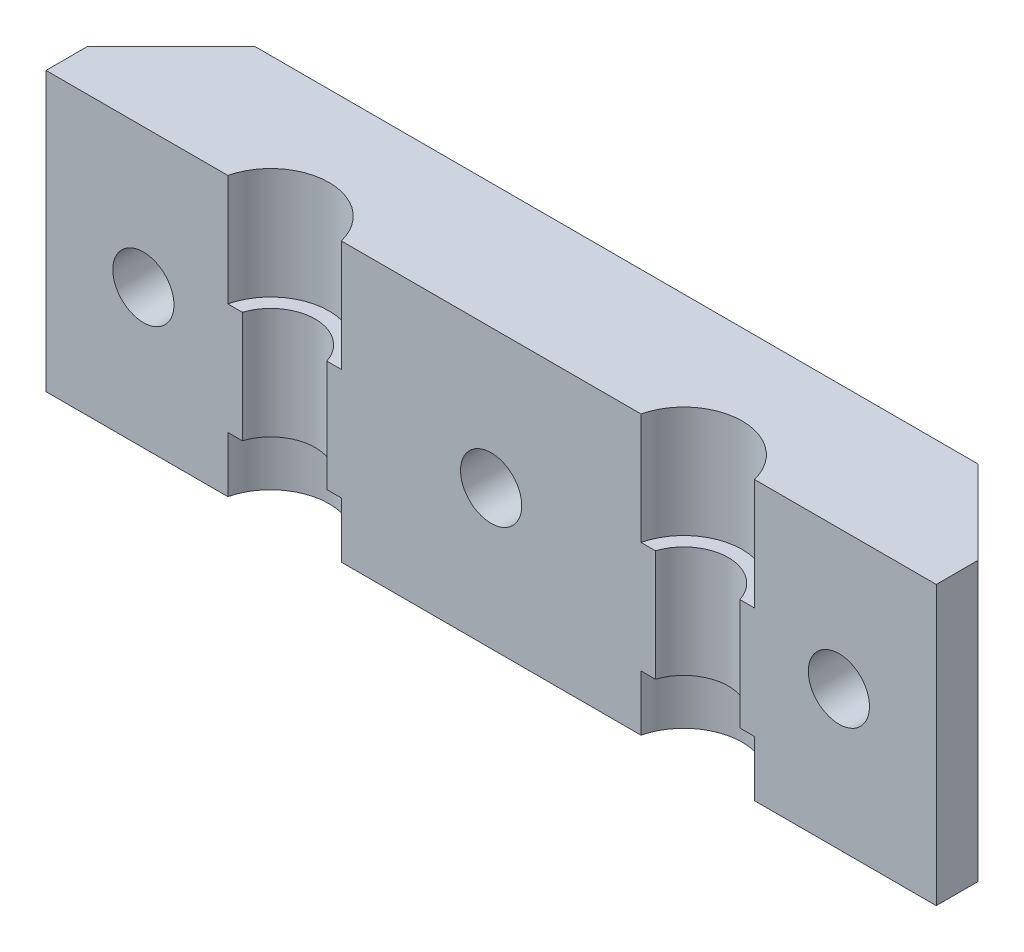
ISO-10303-21;
HEADER;
FILE_DESCRIPTION(('STEP AP214'),'2;1');
FILE_NAME('part.step','',(''),(''),'','','');
FILE_SCHEMA(('AUTOMOTIVE_DESIGN { 1 0 10303 214 1 1 1 1 }'));
ENDSEC;
DATA;
#1=APPLICATION_CONTEXT('core data for automotive mechanical design processes');
#2=APPLICATION_PROTOCOL_DEFINITION('international standard','automotive_design',2000,#1);
#3=PRODUCT_CONTEXT('',#1,'mechanical');
#4=PRODUCT('Part','Part','',(#3));
#5=PRODUCT_RELATED_PRODUCT_CATEGORY('part','',(#4));
#6=PRODUCT_DEFINITION_FORMATION('','',#4);
#7=PRODUCT_DEFINITION_CONTEXT('part definition',#1,'design');
#8=PRODUCT_DEFINITION('design','',#6,#7);
#9=PRODUCT_DEFINITION_SHAPE('','',#8);
#10=(LENGTH_UNIT() NAMED_UNIT(*) SI_UNIT(.MILLI.,.METRE.));
#11=(NAMED_UNIT(*) PLANE_ANGLE_UNIT() SI_UNIT($,.RADIAN.));
#12=(NAMED_UNIT(*) SI_UNIT($,.STERADIAN.) SOLID_ANGLE_UNIT());
#13=UNCERTAINTY_MEASURE_WITH_UNIT(LENGTH_MEASURE(1.E-05),#10,'distance_accuracy_value','');
#14=(GEOMETRIC_REPRESENTATION_CONTEXT(3) GLOBAL_UNCERTAINTY_ASSIGNED_CONTEXT((#13)) GLOBAL_UNIT_ASSIGNED_CONTEXT((#10,
#11,#12)) REPRESENTATION_CONTEXT('',''));
#15=CARTESIAN_POINT('',(0.,0.,0.));
#16=DIRECTION('',(0.,0.,1.));
#17=DIRECTION('',(1.,0.,0.));
#18=AXIS2_PLACEMENT_3D('',#15,#16,#17);
#19=CARTESIAN_POINT('',(23.425,0.,5.));
#20=DIRECTION('',(0.,1.,0.));
#21=DIRECTION('',(0.,0.,1.));
#22=AXIS2_PLACEMENT_3D('',#19,#20,#21);
#23=CYLINDRICAL_SURFACE('',#22,2.1);
#24=CARTESIAN_POINT('',(23.425,6.,5.));
#25=DIRECTION('',(0.,-1.,0.));
#26=DIRECTION('',(0.,0.,-1.));
#27=AXIS2_PLACEMENT_3D('',#24,#25,#26);
#28=CIRCLE('',#27,2.1);
#29=CARTESIAN_POINT('',(21.3853921945629,6.,4.5));
#30=VERTEX_POINT('',#29);
#31=CARTESIAN_POINT('',(25.4646078054371,6.,4.5));
#32=VERTEX_POINT('',#31);
#33=EDGE_CURVE('E210',#30,#32,#28,.T.);
#34=ORIENTED_EDGE('',*,*,#33,.T.);
#35=DIRECTION('',(0.,1.,0.));
#36=VECTOR('',#35,1.);
#37=CARTESIAN_POINT('',(25.4646078054371,0.,4.5));
#38=LINE('',#37,#36);
#39=CARTESIAN_POINT('',(25.4646078054371,10.,4.5));
#40=VERTEX_POINT('',#39);
#41=EDGE_CURVE('E252',#32,#40,#38,.T.);
#42=ORIENTED_EDGE('',*,*,#41,.T.);
#43=CARTESIAN_POINT('',(23.425,10.,5.));
#44=DIRECTION('',(0.,1.,0.));
#45=DIRECTION('',(0.,0.,1.));
#46=AXIS2_PLACEMENT_3D('',#43,#44,#45);
#47=CIRCLE('',#46,2.1);
#48=CARTESIAN_POINT('',(21.3853921945629,10.,4.5));
#49=VERTEX_POINT('',#48);
#50=EDGE_CURVE('E244',#40,#49,#47,.T.);
#51=ORIENTED_EDGE('',*,*,#50,.T.);
#52=DIRECTION('',(0.,1.,0.));
#53=VECTOR('',#52,1.);
#54=CARTESIAN_POINT('',(21.3853921945629,0.,4.5));
#55=LINE('',#54,#53);
#56=EDGE_CURVE('E250',#49,#30,#55,.F.);
#57=ORIENTED_EDGE('',*,*,#56,.T.);
#58=EDGE_LOOP('',(#34,#42,#51,#57));
#59=FACE_BOUND('',#58,.T.);
#60=ADVANCED_FACE('F36',(#59),#23,.F.);
#61=CARTESIAN_POINT('',(8.575,0.,5.));
#62=DIRECTION('',(0.,1.,0.));
#63=DIRECTION('',(0.,0.,1.));
#64=AXIS2_PLACEMENT_3D('',#61,#62,#63);
#65=CYLINDRICAL_SURFACE('',#64,2.1);
#66=CARTESIAN_POINT('',(8.575,6.,5.));
#67=DIRECTION('',(0.,-1.,0.));
#68=DIRECTION('',(0.,0.,-1.));
#69=AXIS2_PLACEMENT_3D('',#66,#67,#68);
#70=CIRCLE('',#69,2.1);
#71=CARTESIAN_POINT('',(6.53539219456288,6.,4.5));
#72=VERTEX_POINT('',#71);
#73=CARTESIAN_POINT('',(10.6146078054371,6.,4.5));
#74=VERTEX_POINT('',#73);
#75=EDGE_CURVE('E199',#72,#74,#70,.T.);
#76=ORIENTED_EDGE('',*,*,#75,.T.);
#77=DIRECTION('',(0.,1.,0.));
#78=VECTOR('',#77,1.);
#79=CARTESIAN_POINT('',(10.6146078054371,0.,4.5));
#80=LINE('',#79,#78);
#81=CARTESIAN_POINT('',(10.6146078054371,10.,4.5));
#82=VERTEX_POINT('',#81);
#83=EDGE_CURVE('E295',#74,#82,#80,.T.);
#84=ORIENTED_EDGE('',*,*,#83,.T.);
#85=CARTESIAN_POINT('',(8.575,10.,5.));
#86=DIRECTION('',(0.,1.,0.));
#87=DIRECTION('',(0.,0.,1.));
#88=AXIS2_PLACEMENT_3D('',#85,#86,#87);
#89=CIRCLE('',#88,2.1);
#90=CARTESIAN_POINT('',(6.53539219456288,10.,4.5));
#91=VERTEX_POINT('',#90);
#92=EDGE_CURVE('E255',#82,#91,#89,.T.);
#93=ORIENTED_EDGE('',*,*,#92,.T.);
#94=DIRECTION('',(0.,1.,0.));
#95=VECTOR('',#94,1.);
#96=CARTESIAN_POINT('',(6.53539219456288,0.,4.5));
#97=LINE('',#96,#95);
#98=EDGE_CURVE('E293',#91,#72,#97,.F.);
#99=ORIENTED_EDGE('',*,*,#98,.T.);
#100=EDGE_LOOP('',(#76,#84,#93,#99));
#101=FACE_BOUND('',#100,.T.);
#102=ADVANCED_FACE('F358',(#101),#65,.F.);
#103=CARTESIAN_POINT('',(0.,0.,4.5));
#104=DIRECTION('',(0.,0.,1.));
#105=DIRECTION('',(1.,0.,0.));
#106=AXIS2_PLACEMENT_3D('',#103,#104,#105);
#107=PLANE('',#106);
#108=CARTESIAN_POINT('',(28.5,5.,4.5));
#109=DIRECTION('',(0.,0.,-1.));
#110=DIRECTION('',(-1.,0.,0.));
#111=AXIS2_PLACEMENT_3D('',#108,#109,#110);
#112=CIRCLE('',#111,1.1);
#113=CARTESIAN_POINT('',(27.4,5.,4.5));
#114=VERTEX_POINT('',#113);
#115=EDGE_CURVE('E212',#114,#114,#112,.T.);
#116=ORIENTED_EDGE('',*,*,#115,.T.);
#117=EDGE_LOOP('',(#116));
#118=FACE_BOUND('',#117,.T.);
#119=CARTESIAN_POINT('',(25.4646078054371,0.,4.5));
#120=VERTEX_POINT('',#119);
#121=CARTESIAN_POINT('',(25.4646078054371,2.,4.5));
#122=VERTEX_POINT('',#121);
#123=EDGE_CURVE('E253',#120,#122,#38,.T.);
#124=ORIENTED_EDGE('',*,*,#123,.F.);
#125=DIRECTION('',(1.,0.,0.));
#126=VECTOR('',#125,1.);
#127=CARTESIAN_POINT('',(0.,0.,4.5));
#128=LINE('',#127,#126);
#129=CARTESIAN_POINT('',(32.,0.,4.5));
#130=VERTEX_POINT('',#129);
#131=EDGE_CURVE('E266',#120,#130,#128,.T.);
#132=ORIENTED_EDGE('',*,*,#131,.T.);
#133=DIRECTION('',(0.,1.,0.));
#134=VECTOR('',#133,1.);
#135=CARTESIAN_POINT('',(32.,0.,4.5));
#136=LINE('',#135,#134);
#137=CARTESIAN_POINT('',(32.,10.,4.5));
#138=VERTEX_POINT('',#137);
#139=EDGE_CURVE('E264',#130,#138,#136,.T.);
#140=ORIENTED_EDGE('',*,*,#139,.T.);
#141=DIRECTION('',(-1.,0.,0.));
#142=VECTOR('',#141,1.);
#143=CARTESIAN_POINT('',(0.,10.,4.5));
#144=LINE('',#143,#142);
#145=EDGE_CURVE('E269',#138,#40,#144,.T.);
#146=ORIENTED_EDGE('',*,*,#145,.T.);
#147=ORIENTED_EDGE('',*,*,#41,.F.);
#148=DIRECTION('',(-1.,0.,0.));
#149=VECTOR('',#148,1.);
#150=CARTESIAN_POINT('',(24.9448684153571,6.,4.5));
#151=LINE('',#150,#149);
#152=CARTESIAN_POINT('',(24.9448684153571,6.,4.5));
#153=VERTEX_POINT('',#152);
#154=EDGE_CURVE('E196',#32,#153,#151,.T.);
#155=ORIENTED_EDGE('',*,*,#154,.T.);
#156=DIRECTION('',(0.,1.,0.));
#157=VECTOR('',#156,1.);
#158=CARTESIAN_POINT('',(24.9448684153571,2.,4.5));
#159=LINE('',#158,#157);
#160=CARTESIAN_POINT('',(24.9448684153571,2.,4.5));
#161=VERTEX_POINT('',#160);
#162=EDGE_CURVE('E192',#161,#153,#159,.T.);
#163=ORIENTED_EDGE('',*,*,#162,.F.);
#164=DIRECTION('',(-1.,0.,0.));
#165=VECTOR('',#164,1.);
#166=CARTESIAN_POINT('',(24.9448684153571,2.,4.5));
#167=LINE('',#166,#165);
#168=EDGE_CURVE('E180',#122,#161,#167,.T.);
#169=ORIENTED_EDGE('',*,*,#168,.F.);
#170=EDGE_LOOP('',(#124,#132,#140,#146,#147,#155,#163,#169));
#171=FACE_BOUND('',#170,.T.);
#172=ADVANCED_FACE('F193',(#118,#171),#107,.T.);
#173=CARTESIAN_POINT('',(16.,5.,4.5));
#174=DIRECTION('',(0.,0.,-1.));
#175=DIRECTION('',(-1.,0.,0.));
#176=AXIS2_PLACEMENT_3D('',#173,#174,#175);
#177=CIRCLE('',#176,1.1);
#178=CARTESIAN_POINT('',(14.9,5.,4.5));
#179=VERTEX_POINT('',#178);
#180=EDGE_CURVE('E597',#179,#179,#177,.T.);
#181=ORIENTED_EDGE('',*,*,#180,.T.);
#182=EDGE_LOOP('',(#181));
#183=FACE_BOUND('',#182,.T.);
#184=ORIENTED_EDGE('',*,*,#56,.F.);
#185=EDGE_CURVE('E273',#49,#82,#144,.T.);
#186=ORIENTED_EDGE('',*,*,#185,.T.);
#187=ORIENTED_EDGE('',*,*,#83,.F.);
#188=DIRECTION('',(-1.,0.,0.));
#189=VECTOR('',#188,1.);
#190=CARTESIAN_POINT('',(10.0948684153571,6.,4.5));
#191=LINE('',#190,#189);
#192=CARTESIAN_POINT('',(10.0948684153571,6.,4.5));
#193=VERTEX_POINT('',#192);
#194=EDGE_CURVE('E233',#74,#193,#191,.T.);
#195=ORIENTED_EDGE('',*,*,#194,.T.);
#196=DIRECTION('',(0.,1.,0.));
#197=VECTOR('',#196,1.);
#198=CARTESIAN_POINT('',(10.0948684153571,2.,4.5));
#199=LINE('',#198,#197);
#200=CARTESIAN_POINT('',(10.0948684153571,2.,4.5));
#201=VERTEX_POINT('',#200);
#202=EDGE_CURVE('E241',#201,#193,#199,.T.);
#203=ORIENTED_EDGE('',*,*,#202,.F.);
#204=DIRECTION('',(-1.,0.,0.));
#205=VECTOR('',#204,1.);
#206=CARTESIAN_POINT('',(10.0948684153571,2.,4.5));
#207=LINE('',#206,#205);
#208=CARTESIAN_POINT('',(10.6146078054371,2.,4.5));
#209=VERTEX_POINT('',#208);
#210=EDGE_CURVE('E223',#209,#201,#207,.T.);
#211=ORIENTED_EDGE('',*,*,#210,.F.);
#212=CARTESIAN_POINT('',(10.6146078054371,0.,4.5));
#213=VERTEX_POINT('',#212);
#214=EDGE_CURVE('E296',#213,#209,#80,.T.);
#215=ORIENTED_EDGE('',*,*,#214,.F.);
#216=CARTESIAN_POINT('',(21.3853921945629,0.,4.5));
#217=VERTEX_POINT('',#216);
#218=EDGE_CURVE('E265',#213,#217,#128,.T.);
#219=ORIENTED_EDGE('',*,*,#218,.T.);
#220=CARTESIAN_POINT('',(21.3853921945629,2.,4.5));
#221=VERTEX_POINT('',#220);
#222=EDGE_CURVE('E248',#221,#217,#55,.F.);
#223=ORIENTED_EDGE('',*,*,#222,.F.);
#224=DIRECTION('',(-1.,0.,0.));
#225=VECTOR('',#224,1.);
#226=CARTESIAN_POINT('',(21.3853921945629,2.,4.5));
#227=LINE('',#226,#225);
#228=CARTESIAN_POINT('',(21.9051315846429,2.,4.5));
#229=VERTEX_POINT('',#228);
#230=EDGE_CURVE('E205',#229,#221,#227,.T.);
#231=ORIENTED_EDGE('',*,*,#230,.F.);
#232=DIRECTION('',(0.,1.,0.));
#233=VECTOR('',#232,1.);
#234=CARTESIAN_POINT('',(21.9051315846429,2.,4.5));
#235=LINE('',#234,#233);
#236=CARTESIAN_POINT('',(21.9051315846429,6.,4.5));
#237=VERTEX_POINT('',#236);
#238=EDGE_CURVE('E200',#229,#237,#235,.T.);
#239=ORIENTED_EDGE('',*,*,#238,.T.);
#240=DIRECTION('',(-1.,0.,0.));
#241=VECTOR('',#240,1.);
#242=CARTESIAN_POINT('',(21.3853921945629,6.,4.5));
#243=LINE('',#242,#241);
#244=EDGE_CURVE('E216',#237,#30,#243,.T.);
#245=ORIENTED_EDGE('',*,*,#244,.T.);
#246=EDGE_LOOP('',(#184,#186,#187,#195,#203,#211,#215,#219,#223,#231,#239,#245));
#247=FACE_BOUND('',#246,.T.);
#248=ADVANCED_FACE('F391',(#183,#247),#107,.T.);
#249=CARTESIAN_POINT('',(0.,0.,4.5));
#250=DIRECTION('',(0.,1.,0.));
#251=DIRECTION('',(-1.,0.,0.));
#252=AXIS2_PLACEMENT_3D('',#249,#250,#251);
#253=PLANE('',#252);
#254=DIRECTION('',(0.,0.,-1.));
#255=VECTOR('',#254,1.);
#256=CARTESIAN_POINT('',(0.,0.,4.5));
#257=LINE('',#256,#255);
#258=CARTESIAN_POINT('',(0.,0.,4.5));
#259=VERTEX_POINT('',#258);
#260=CARTESIAN_POINT('',(0.,0.,3.));
#261=VERTEX_POINT('',#260);
#262=EDGE_CURVE('E275',#259,#261,#257,.T.);
#263=ORIENTED_EDGE('',*,*,#262,.T.);
#264=DIRECTION('',(-0.707106781186549,0.,0.707106781186546));
#265=VECTOR('',#264,1.);
#266=CARTESIAN_POINT('',(0.,0.,3.));
#267=LINE('',#266,#265);
#268=CARTESIAN_POINT('',(3.00000000000001,0.,0.));
#269=VERTEX_POINT('',#268);
#270=EDGE_CURVE('E303',#261,#269,#267,.F.);
#271=ORIENTED_EDGE('',*,*,#270,.T.);
#272=DIRECTION('',(1.,0.,0.));
#273=VECTOR('',#272,1.);
#274=CARTESIAN_POINT('',(0.,0.,0.));
#275=LINE('',#274,#273);
#276=CARTESIAN_POINT('',(29.,0.,0.));
#277=VERTEX_POINT('',#276);
#278=EDGE_CURVE('E259',#269,#277,#275,.T.);
#279=ORIENTED_EDGE('',*,*,#278,.T.);
#280=DIRECTION('',(-0.707106781186549,0.,-0.707106781186546));
#281=VECTOR('',#280,1.);
#282=CARTESIAN_POINT('',(32.,0.,3.));
#283=LINE('',#282,#281);
#284=CARTESIAN_POINT('',(32.,0.,3.));
#285=VERTEX_POINT('',#284);
#286=EDGE_CURVE('E301',#277,#285,#283,.F.);
#287=ORIENTED_EDGE('',*,*,#286,.T.);
#288=DIRECTION('',(0.,0.,-1.));
#289=VECTOR('',#288,1.);
#290=CARTESIAN_POINT('',(32.,0.,4.5));
#291=LINE('',#290,#289);
#292=EDGE_CURVE('E289',#130,#285,#291,.T.);
#293=ORIENTED_EDGE('',*,*,#292,.F.);
#294=ORIENTED_EDGE('',*,*,#131,.F.);
#295=CARTESIAN_POINT('',(23.425,0.,5.));
#296=DIRECTION('',(0.,1.,0.));
#297=DIRECTION('',(0.,0.,1.));
#298=AXIS2_PLACEMENT_3D('',#295,#296,#297);
#299=CIRCLE('',#298,2.1);
#300=EDGE_CURVE('E245',#120,#217,#299,.T.);
#301=ORIENTED_EDGE('',*,*,#300,.T.);
#302=ORIENTED_EDGE('',*,*,#218,.F.);
#303=CARTESIAN_POINT('',(8.575,0.,5.));
#304=DIRECTION('',(0.,1.,0.));
#305=DIRECTION('',(0.,0.,1.));
#306=AXIS2_PLACEMENT_3D('',#303,#304,#305);
#307=CIRCLE('',#306,2.1);
#308=CARTESIAN_POINT('',(6.53539219456288,0.,4.5));
#309=VERTEX_POINT('',#308);
#310=EDGE_CURVE('E256',#213,#309,#307,.T.);
#311=ORIENTED_EDGE('',*,*,#310,.T.);
#312=EDGE_CURVE('E261',#259,#309,#128,.T.);
#313=ORIENTED_EDGE('',*,*,#312,.F.);
#314=EDGE_LOOP('',(#263,#271,#279,#287,#293,#294,#301,#302,#311,#313));
#315=FACE_BOUND('',#314,.T.);
#316=ADVANCED_FACE('F385',(#315),#253,.F.);
#317=CARTESIAN_POINT('',(32.,0.,4.5));
#318=DIRECTION('',(-1.,0.,0.));
#319=DIRECTION('',(0.,0.,1.));
#320=AXIS2_PLACEMENT_3D('',#317,#318,#319);
#321=PLANE('',#320);
#322=ORIENTED_EDGE('',*,*,#292,.T.);
#323=DIRECTION('',(0.,1.,0.));
#324=VECTOR('',#323,1.);
#325=CARTESIAN_POINT('',(32.,0.,3.));
#326=LINE('',#325,#324);
#327=CARTESIAN_POINT('',(32.,10.,3.));
#328=VERTEX_POINT('',#327);
#329=EDGE_CURVE('E317',#285,#328,#326,.T.);
#330=ORIENTED_EDGE('',*,*,#329,.T.);
#331=DIRECTION('',(0.,0.,-1.));
#332=VECTOR('',#331,1.);
#333=CARTESIAN_POINT('',(32.,10.,4.5));
#334=LINE('',#333,#332);
#335=EDGE_CURVE('E286',#138,#328,#334,.T.);
#336=ORIENTED_EDGE('',*,*,#335,.F.);
#337=ORIENTED_EDGE('',*,*,#139,.F.);
#338=EDGE_LOOP('',(#322,#330,#336,#337));
#339=FACE_BOUND('',#338,.T.);
#340=ADVANCED_FACE('F424',(#339),#321,.F.);
#341=CARTESIAN_POINT('',(0.,10.,4.5));
#342=DIRECTION('',(0.,-1.,0.));
#343=DIRECTION('',(0.,0.,-1.));
#344=AXIS2_PLACEMENT_3D('',#341,#342,#343);
#345=PLANE('',#344);
#346=DIRECTION('',(-1.,0.,0.));
#347=VECTOR('',#346,1.);
#348=CARTESIAN_POINT('',(0.,10.,0.));
#349=LINE('',#348,#347);
#350=CARTESIAN_POINT('',(29.,10.,0.));
#351=VERTEX_POINT('',#350);
#352=CARTESIAN_POINT('',(3.00000000000001,10.,0.));
#353=VERTEX_POINT('',#352);
#354=EDGE_CURVE('E278',#351,#353,#349,.T.);
#355=ORIENTED_EDGE('',*,*,#354,.T.);
#356=DIRECTION('',(0.707106781186549,0.,-0.707106781186546));
#357=VECTOR('',#356,1.);
#358=CARTESIAN_POINT('',(0.,10.,3.));
#359=LINE('',#358,#357);
#360=CARTESIAN_POINT('',(0.,10.,3.));
#361=VERTEX_POINT('',#360);
#362=EDGE_CURVE('E315',#353,#361,#359,.F.);
#363=ORIENTED_EDGE('',*,*,#362,.T.);
#364=DIRECTION('',(0.,0.,-1.));
#365=VECTOR('',#364,1.);
#366=CARTESIAN_POINT('',(0.,10.,4.5));
#367=LINE('',#366,#365);
#368=CARTESIAN_POINT('',(0.,10.,4.5));
#369=VERTEX_POINT('',#368);
#370=EDGE_CURVE('E283',#369,#361,#367,.T.);
#371=ORIENTED_EDGE('',*,*,#370,.F.);
#372=EDGE_CURVE('E268',#91,#369,#144,.T.);
#373=ORIENTED_EDGE('',*,*,#372,.F.);
#374=ORIENTED_EDGE('',*,*,#92,.F.);
#375=ORIENTED_EDGE('',*,*,#185,.F.);
#376=ORIENTED_EDGE('',*,*,#50,.F.);
#377=ORIENTED_EDGE('',*,*,#145,.F.);
#378=ORIENTED_EDGE('',*,*,#335,.T.);
#379=DIRECTION('',(0.707106781186549,0.,0.707106781186546));
#380=VECTOR('',#379,1.);
#381=CARTESIAN_POINT('',(32.,10.,3.));
#382=LINE('',#381,#380);
#383=EDGE_CURVE('E313',#328,#351,#382,.F.);
#384=ORIENTED_EDGE('',*,*,#383,.T.);
#385=EDGE_LOOP('',(#355,#363,#371,#373,#374,#375,#376,#377,#378,#384));
#386=FACE_BOUND('',#385,.T.);
#387=ADVANCED_FACE('F418',(#386),#345,.F.);
#388=CARTESIAN_POINT('',(0.,0.,4.5));
#389=DIRECTION('',(1.,0.,0.));
#390=DIRECTION('',(0.,0.,-1.));
#391=AXIS2_PLACEMENT_3D('',#388,#389,#390);
#392=PLANE('',#391);
#393=ORIENTED_EDGE('',*,*,#370,.T.);
#394=DIRECTION('',(0.,-1.,0.));
#395=VECTOR('',#394,1.);
#396=CARTESIAN_POINT('',(0.,0.,3.));
#397=LINE('',#396,#395);
#398=EDGE_CURVE('E298',#361,#261,#397,.T.);
#399=ORIENTED_EDGE('',*,*,#398,.T.);
#400=ORIENTED_EDGE('',*,*,#262,.F.);
#401=DIRECTION('',(0.,-1.,0.));
#402=VECTOR('',#401,1.);
#403=CARTESIAN_POINT('',(0.,0.,4.5));
#404=LINE('',#403,#402);
#405=EDGE_CURVE('E272',#369,#259,#404,.T.);
#406=ORIENTED_EDGE('',*,*,#405,.F.);
#407=EDGE_LOOP('',(#393,#399,#400,#406));
#408=FACE_BOUND('',#407,.T.);
#409=ADVANCED_FACE('F404',(#408),#392,.F.);
#410=CARTESIAN_POINT('',(3.50000000000001,5.,4.5));
#411=DIRECTION('',(0.,0.,-1.));
#412=DIRECTION('',(-1.,0.,0.));
#413=AXIS2_PLACEMENT_3D('',#410,#411,#412);
#414=CIRCLE('',#413,1.1);
#415=CARTESIAN_POINT('',(2.40000000000001,5.,4.5));
#416=VERTEX_POINT('',#415);
#417=EDGE_CURVE('E596',#416,#416,#414,.T.);
#418=ORIENTED_EDGE('',*,*,#417,.T.);
#419=EDGE_LOOP('',(#418));
#420=FACE_BOUND('',#419,.T.);
#421=ORIENTED_EDGE('',*,*,#98,.F.);
#422=ORIENTED_EDGE('',*,*,#372,.T.);
#423=ORIENTED_EDGE('',*,*,#405,.T.);
#424=ORIENTED_EDGE('',*,*,#312,.T.);
#425=CARTESIAN_POINT('',(6.53539219456288,2.,4.5));
#426=VERTEX_POINT('',#425);
#427=EDGE_CURVE('E292',#426,#309,#97,.F.);
#428=ORIENTED_EDGE('',*,*,#427,.F.);
#429=DIRECTION('',(-1.,0.,0.));
#430=VECTOR('',#429,1.);
#431=CARTESIAN_POINT('',(6.53539219456288,2.,4.5));
#432=LINE('',#431,#430);
#433=CARTESIAN_POINT('',(7.05513158464293,2.,4.5));
#434=VERTEX_POINT('',#433);
#435=EDGE_CURVE('E228',#434,#426,#432,.T.);
#436=ORIENTED_EDGE('',*,*,#435,.F.);
#437=DIRECTION('',(0.,1.,0.));
#438=VECTOR('',#437,1.);
#439=CARTESIAN_POINT('',(7.05513158464293,2.,4.5));
#440=LINE('',#439,#438);
#441=CARTESIAN_POINT('',(7.05513158464293,6.,4.5));
#442=VERTEX_POINT('',#441);
#443=EDGE_CURVE('E231',#434,#442,#440,.T.);
#444=ORIENTED_EDGE('',*,*,#443,.T.);
#445=DIRECTION('',(-1.,0.,0.));
#446=VECTOR('',#445,1.);
#447=CARTESIAN_POINT('',(6.53539219456288,6.,4.5));
#448=LINE('',#447,#446);
#449=EDGE_CURVE('E224',#442,#72,#448,.T.);
#450=ORIENTED_EDGE('',*,*,#449,.T.);
#451=EDGE_LOOP('',(#421,#422,#423,#424,#428,#436,#444,#450));
#452=FACE_BOUND('',#451,.T.);
#453=ADVANCED_FACE('F397',(#420,#452),#107,.T.);
#454=CARTESIAN_POINT('',(0.,0.,0.));
#455=DIRECTION('',(0.,0.,1.));
#456=DIRECTION('',(1.,0.,0.));
#457=AXIS2_PLACEMENT_3D('',#454,#455,#456);
#458=PLANE('',#457);
#459=CARTESIAN_POINT('',(16.,5.,0.));
#460=DIRECTION('',(0.,0.,1.));
#461=DIRECTION('',(1.,0.,0.));
#462=AXIS2_PLACEMENT_3D('',#459,#460,#461);
#463=CIRCLE('',#462,2.60000000000001);
#464=CARTESIAN_POINT('',(18.6,5.,0.));
#465=VERTEX_POINT('',#464);
#466=EDGE_CURVE('E324',#465,#465,#463,.T.);
#467=ORIENTED_EDGE('',*,*,#466,.T.);
#468=EDGE_LOOP('',(#467));
#469=FACE_BOUND('',#468,.T.);
#470=DIRECTION('',(0.,1.,0.));
#471=VECTOR('',#470,1.);
#472=CARTESIAN_POINT('',(3.00000000000001,0.,0.));
#473=LINE('',#472,#471);
#474=CARTESIAN_POINT('',(3.00000000000001,2.44852983556537,0.));
#475=VERTEX_POINT('',#474);
#476=EDGE_CURVE('E310',#269,#475,#473,.T.);
#477=ORIENTED_EDGE('',*,*,#476,.T.);
#478=CARTESIAN_POINT('',(3.50000000000001,5.,0.));
#479=DIRECTION('',(0.,0.,1.));
#480=DIRECTION('',(1.,0.,0.));
#481=AXIS2_PLACEMENT_3D('',#478,#479,#480);
#482=CIRCLE('',#481,2.60000000000001);
#483=CARTESIAN_POINT('',(3.00000000000001,7.55147016443462,0.));
#484=VERTEX_POINT('',#483);
#485=EDGE_CURVE('E327',#475,#484,#482,.T.);
#486=ORIENTED_EDGE('',*,*,#485,.T.);
#487=EDGE_CURVE('E309',#484,#353,#473,.T.);
#488=ORIENTED_EDGE('',*,*,#487,.T.);
#489=ORIENTED_EDGE('',*,*,#354,.F.);
#490=DIRECTION('',(0.,-1.,0.));
#491=VECTOR('',#490,1.);
#492=CARTESIAN_POINT('',(29.,0.,0.));
#493=LINE('',#492,#491);
#494=CARTESIAN_POINT('',(29.,7.55147016443462,0.));
#495=VERTEX_POINT('',#494);
#496=EDGE_CURVE('E306',#351,#495,#493,.T.);
#497=ORIENTED_EDGE('',*,*,#496,.T.);
#498=CARTESIAN_POINT('',(28.5,5.,0.));
#499=DIRECTION('',(0.,0.,1.));
#500=DIRECTION('',(1.,0.,0.));
#501=AXIS2_PLACEMENT_3D('',#498,#499,#500);
#502=CIRCLE('',#501,2.60000000000001);
#503=CARTESIAN_POINT('',(29.,2.44852983556537,0.));
#504=VERTEX_POINT('',#503);
#505=EDGE_CURVE('E321',#495,#504,#502,.T.);
#506=ORIENTED_EDGE('',*,*,#505,.T.);
#507=EDGE_CURVE('E305',#504,#277,#493,.T.);
#508=ORIENTED_EDGE('',*,*,#507,.T.);
#509=ORIENTED_EDGE('',*,*,#278,.F.);
#510=EDGE_LOOP('',(#477,#486,#488,#489,#497,#506,#508,#509));
#511=FACE_BOUND('',#510,.T.);
#512=ADVANCED_FACE('F378',(#469,#511),#458,.F.);
#513=ORIENTED_EDGE('',*,*,#214,.T.);
#514=CARTESIAN_POINT('',(8.575,2.,5.));
#515=DIRECTION('',(0.,-1.,0.));
#516=DIRECTION('',(0.,0.,-1.));
#517=AXIS2_PLACEMENT_3D('',#514,#515,#516);
#518=CIRCLE('',#517,2.1);
#519=EDGE_CURVE('E220',#426,#209,#518,.T.);
#520=ORIENTED_EDGE('',*,*,#519,.F.);
#521=ORIENTED_EDGE('',*,*,#427,.T.);
#522=ORIENTED_EDGE('',*,*,#310,.F.);
#523=EDGE_LOOP('',(#513,#520,#521,#522));
#524=FACE_BOUND('',#523,.T.);
#525=ADVANCED_FACE('F367',(#524),#65,.F.);
#526=ORIENTED_EDGE('',*,*,#123,.T.);
#527=CARTESIAN_POINT('',(23.425,2.,5.));
#528=DIRECTION('',(0.,-1.,0.));
#529=DIRECTION('',(0.,0.,-1.));
#530=AXIS2_PLACEMENT_3D('',#527,#528,#529);
#531=CIRCLE('',#530,2.1);
#532=EDGE_CURVE('E187',#221,#122,#531,.T.);
#533=ORIENTED_EDGE('',*,*,#532,.F.);
#534=ORIENTED_EDGE('',*,*,#222,.T.);
#535=ORIENTED_EDGE('',*,*,#300,.F.);
#536=EDGE_LOOP('',(#526,#533,#534,#535));
#537=FACE_BOUND('',#536,.T.);
#538=ADVANCED_FACE('F361',(#537),#23,.F.);
#539=CARTESIAN_POINT('',(8.575,2.,5.));
#540=DIRECTION('',(0.,1.,0.));
#541=DIRECTION('',(0.,0.,1.));
#542=AXIS2_PLACEMENT_3D('',#539,#540,#541);
#543=CYLINDRICAL_SURFACE('',#542,1.6);
#544=CARTESIAN_POINT('',(8.575,6.,5.));
#545=DIRECTION('',(0.,1.,0.));
#546=DIRECTION('',(0.,0.,-1.));
#547=AXIS2_PLACEMENT_3D('',#544,#545,#546);
#548=CIRCLE('',#547,1.6);
#549=EDGE_CURVE('E235',#193,#442,#548,.T.);
#550=ORIENTED_EDGE('',*,*,#549,.T.);
#551=ORIENTED_EDGE('',*,*,#443,.F.);
#552=CARTESIAN_POINT('',(8.575,2.,5.));
#553=DIRECTION('',(0.,1.,0.));
#554=DIRECTION('',(0.,0.,-1.));
#555=AXIS2_PLACEMENT_3D('',#552,#553,#554);
#556=CIRCLE('',#555,1.6);
#557=EDGE_CURVE('E226',#201,#434,#556,.T.);
#558=ORIENTED_EDGE('',*,*,#557,.F.);
#559=ORIENTED_EDGE('',*,*,#202,.T.);
#560=EDGE_LOOP('',(#550,#551,#558,#559));
#561=FACE_BOUND('',#560,.T.);
#562=ADVANCED_FACE('F370',(#561),#543,.F.);
#563=CARTESIAN_POINT('',(8.575,2.,5.));
#564=DIRECTION('',(0.,-1.,0.));
#565=DIRECTION('',(0.,0.,-1.));
#566=AXIS2_PLACEMENT_3D('',#563,#564,#565);
#567=PLANE('',#566);
#568=ORIENTED_EDGE('',*,*,#519,.T.);
#569=ORIENTED_EDGE('',*,*,#210,.T.);
#570=ORIENTED_EDGE('',*,*,#557,.T.);
#571=ORIENTED_EDGE('',*,*,#435,.T.);
#572=EDGE_LOOP('',(#568,#569,#570,#571));
#573=FACE_BOUND('',#572,.T.);
#574=ADVANCED_FACE('F376',(#573),#567,.T.);
#575=CARTESIAN_POINT('',(8.575,6.,5.));
#576=DIRECTION('',(0.,-1.,0.));
#577=DIRECTION('',(0.,0.,-1.));
#578=AXIS2_PLACEMENT_3D('',#575,#576,#577);
#579=PLANE('',#578);
#580=ORIENTED_EDGE('',*,*,#75,.F.);
#581=ORIENTED_EDGE('',*,*,#449,.F.);
#582=ORIENTED_EDGE('',*,*,#549,.F.);
#583=ORIENTED_EDGE('',*,*,#194,.F.);
#584=EDGE_LOOP('',(#580,#581,#582,#583));
#585=FACE_BOUND('',#584,.T.);
#586=ADVANCED_FACE('F446',(#585),#579,.F.);
#587=CARTESIAN_POINT('',(23.425,2.,5.));
#588=DIRECTION('',(0.,1.,0.));
#589=DIRECTION('',(0.,0.,1.));
#590=AXIS2_PLACEMENT_3D('',#587,#588,#589);
#591=CYLINDRICAL_SURFACE('',#590,1.6);
#592=CARTESIAN_POINT('',(23.425,6.,5.));
#593=DIRECTION('',(0.,1.,0.));
#594=DIRECTION('',(0.,0.,-1.));
#595=AXIS2_PLACEMENT_3D('',#592,#593,#594);
#596=CIRCLE('',#595,1.6);
#597=EDGE_CURVE('E214',#153,#237,#596,.T.);
#598=ORIENTED_EDGE('',*,*,#597,.T.);
#599=ORIENTED_EDGE('',*,*,#238,.F.);
#600=CARTESIAN_POINT('',(23.425,2.,5.));
#601=DIRECTION('',(0.,1.,0.));
#602=DIRECTION('',(0.,0.,-1.));
#603=AXIS2_PLACEMENT_3D('',#600,#601,#602);
#604=CIRCLE('',#603,1.6);
#605=EDGE_CURVE('E185',#161,#229,#604,.T.);
#606=ORIENTED_EDGE('',*,*,#605,.F.);
#607=ORIENTED_EDGE('',*,*,#162,.T.);
#608=EDGE_LOOP('',(#598,#599,#606,#607));
#609=FACE_BOUND('',#608,.T.);
#610=ADVANCED_FACE('F202',(#609),#591,.F.);
#611=CARTESIAN_POINT('',(23.425,2.,5.));
#612=DIRECTION('',(0.,-1.,0.));
#613=DIRECTION('',(0.,0.,-1.));
#614=AXIS2_PLACEMENT_3D('',#611,#612,#613);
#615=PLANE('',#614);
#616=ORIENTED_EDGE('',*,*,#532,.T.);
#617=ORIENTED_EDGE('',*,*,#168,.T.);
#618=ORIENTED_EDGE('',*,*,#605,.T.);
#619=ORIENTED_EDGE('',*,*,#230,.T.);
#620=EDGE_LOOP('',(#616,#617,#618,#619));
#621=FACE_BOUND('',#620,.T.);
#622=ADVANCED_FACE('F182',(#621),#615,.T.);
#623=CARTESIAN_POINT('',(23.425,6.,5.));
#624=DIRECTION('',(0.,-1.,0.));
#625=DIRECTION('',(0.,0.,-1.));
#626=AXIS2_PLACEMENT_3D('',#623,#624,#625);
#627=PLANE('',#626);
#628=ORIENTED_EDGE('',*,*,#33,.F.);
#629=ORIENTED_EDGE('',*,*,#244,.F.);
#630=ORIENTED_EDGE('',*,*,#597,.F.);
#631=ORIENTED_EDGE('',*,*,#154,.F.);
#632=EDGE_LOOP('',(#628,#629,#630,#631));
#633=FACE_BOUND('',#632,.T.);
#634=ADVANCED_FACE('F433',(#633),#627,.F.);
#635=CARTESIAN_POINT('',(0.,0.,3.));
#636=DIRECTION('',(0.707106781186546,0.,0.707106781186549));
#637=DIRECTION('',(0.,-1.,0.));
#638=AXIS2_PLACEMENT_3D('',#635,#636,#637);
#639=PLANE('',#638);
#640=ORIENTED_EDGE('',*,*,#487,.F.);
#641=CARTESIAN_POINT('',(3.00000000000001,7.55147016443462,0.));
#642=CARTESIAN_POINT('',(2.96599928201031,7.51015683863965,0.0340007179897028));
#643=CARTESIAN_POINT('',(2.9323477738445,7.46827060099669,0.0676522261555075));
#644=CARTESIAN_POINT('',(2.8658243429117,7.38325846201475,0.134175657088306));
#645=CARTESIAN_POINT('',(2.83295259108518,7.34013229335533,0.167047408914832));
#646=CARTESIAN_POINT('',(2.73541953272301,7.20846823427555,0.264580467277001));
#647=CARTESIAN_POINT('',(2.67208413208845,7.11793811174638,0.327915867911562));
#648=CARTESIAN_POINT('',(2.54875148774287,6.92908118806831,0.45124851225714));
#649=CARTESIAN_POINT('',(2.48884418087423,6.83063622027127,0.511155819125775));
#650=CARTESIAN_POINT('',(2.37525471887614,6.62693899999607,0.624745281123867));
#651=CARTESIAN_POINT('',(2.3215628906888,6.52169773330255,0.678437109311205));
#652=CARTESIAN_POINT('',(2.24450551474905,6.35260813621776,0.755494485250954));
#653=CARTESIAN_POINT('',(2.21832301546294,6.29131744987449,0.781676984537062));
#654=CARTESIAN_POINT('',(2.1688216134421,6.16644441785138,0.831178386557907));
#655=CARTESIAN_POINT('',(2.14550283266125,6.10286197472416,0.854497167338752));
#656=CARTESIAN_POINT('',(2.10226973882567,5.97376509600889,0.897730261174339));
#657=CARTESIAN_POINT('',(2.08234039558948,5.90826078508834,0.917659604410522));
#658=CARTESIAN_POINT('',(2.04621842841897,5.77522649396514,0.953781571581041));
#659=CARTESIAN_POINT('',(2.0300249062484,5.70769700511551,0.969975093751611));
#660=CARTESIAN_POINT('',(2.00161868447319,5.56994980231929,0.998381315526815));
#661=CARTESIAN_POINT('',(1.98946441772956,5.49970777478582,1.01053558227045));
#662=CARTESIAN_POINT('',(1.96985150609939,5.35791536834109,1.03014849390062));
#663=CARTESIAN_POINT('',(1.96239269660699,5.28636503538482,1.03760730339301));
#664=CARTESIAN_POINT('',(1.95244542262421,5.14257864245395,1.0475545773758));
#665=CARTESIAN_POINT('',(1.9499564010801,5.0703426602445,1.0500435989199));
#666=CARTESIAN_POINT('',(1.95004474950104,4.92588012718903,1.04995525049897));
#667=CARTESIAN_POINT('',(1.95262173575959,4.85365357604307,1.04737826424041));
#668=CARTESIAN_POINT('',(1.96213103054293,4.71855178634058,1.03786896945708));
#669=CARTESIAN_POINT('',(1.96850271546571,4.65559586124925,1.03149728453429));
#670=CARTESIAN_POINT('',(1.98490218464306,4.53063465970789,1.01509781535694));
#671=CARTESIAN_POINT('',(1.99493111865844,4.46862968861238,1.00506888134156));
#672=CARTESIAN_POINT('',(2.03011661133924,4.28464988275926,0.969883388660765));
#673=CARTESIAN_POINT('',(2.06038029793184,4.16460036015507,0.939619702068162));
#674=CARTESIAN_POINT('',(2.15066838967068,3.87051430945635,0.849331610329323));
#675=CARTESIAN_POINT('',(2.21798154574358,3.70100711875884,0.782018454256429));
#676=CARTESIAN_POINT('',(2.33204855337678,3.45879646008093,0.667951446623229));
#677=CARTESIAN_POINT('',(2.37246801780861,3.37973614433106,0.627531982191394));
#678=CARTESIAN_POINT('',(2.45689871188768,3.22554038351865,0.543101288112324));
#679=CARTESIAN_POINT('',(2.50090909931457,3.15040402486709,0.499090900685441));
#680=CARTESIAN_POINT('',(2.59195166900231,3.00362749162052,0.408048330997696));
#681=CARTESIAN_POINT('',(2.63899038637262,2.93199550800161,0.36100961362739));
#682=CARTESIAN_POINT('',(2.73549583790362,2.79206843331074,0.264504162096389));
#683=CARTESIAN_POINT('',(2.78496306012306,2.72377401854152,0.215036939876946));
#684=CARTESIAN_POINT('',(2.9365328464512,2.52321750431938,0.0634671535488053));
#685=CARTESIAN_POINT('',(3.04165570472524,2.39551390833235,-0.0416557047252265));
#686=CARTESIAN_POINT('',(3.2538669082044,2.15430262864424,-0.253866908204394));
#687=CARTESIAN_POINT('',(3.36076846487712,2.04046085842877,-0.360768464877107));
#688=CARTESIAN_POINT('',(3.52380871520025,1.87580448121339,-0.52380871520024));
#689=CARTESIAN_POINT('',(3.57847833224351,1.82205007218907,-0.578478332243496));
#690=CARTESIAN_POINT('',(3.6886602465896,1.71633106086898,-0.68866024658959));
#691=CARTESIAN_POINT('',(3.74417236670109,1.66436608954093,-0.744172366701081));
#692=CARTESIAN_POINT('',(3.80005453085368,1.61321124200324,-0.800054530853664));
#693=B_SPLINE_CURVE_WITH_KNOTS('',3,(#641,#642,#643,#644,#645,#646,#647,#648,#649,#650,#651,
#652,#653,#654,#655,#656,#657,#658,#659,#660,#661,#662,#663,#664,#665,#666,#667,#668,#669,#670,
#671,#672,#673,#674,#675,#676,#677,#678,#679,#680,#681,#682,#683,#684,#685,#686,#687,#688,#689,
#690,#691,#692),.UNSPECIFIED.,.F.,.F.,(4,2,2,2,2,2,2,2,2,2,2,2,2,2,2,2,2,2,2,2,2,2,2,2,2,4),(0.,
0.190175010584689,0.380391333642397,0.76217992390665,1.15146324410682,1.54013234341812,
1.75482961613688,1.96953602875364,2.183264006381,2.3969405418326,2.6135857670438,
2.83022339702916,3.046836743167,3.26343368334021,3.45400083220946,3.64462794303119,
4.02555479442605,4.60532001686543,4.89787716705318,5.19036589661897,5.48350846685455,
5.77671019332518,6.36404661981103,6.9315143434676,7.21398878582769,7.49640462083642),.UNSPECIFIED.);
#694=EDGE_CURVE('E330',#484,#475,#693,.T.);
#695=ORIENTED_EDGE('',*,*,#694,.T.);
#696=ORIENTED_EDGE('',*,*,#476,.F.);
#697=ORIENTED_EDGE('',*,*,#270,.F.);
#698=ORIENTED_EDGE('',*,*,#398,.F.);
#699=ORIENTED_EDGE('',*,*,#362,.F.);
#700=EDGE_LOOP('',(#640,#695,#696,#697,#698,#699));
#701=FACE_BOUND('',#700,.T.);
#702=ADVANCED_FACE('F338',(#701),#639,.F.);
#703=CARTESIAN_POINT('',(32.,0.,3.));
#704=DIRECTION('',(-0.707106781186546,0.,0.707106781186549));
#705=DIRECTION('',(0.,1.,0.));
#706=AXIS2_PLACEMENT_3D('',#703,#704,#705);
#707=PLANE('',#706);
#708=ORIENTED_EDGE('',*,*,#507,.F.);
#709=CARTESIAN_POINT('',(29.,2.44852983556537,0.));
#710=CARTESIAN_POINT('',(29.0340007179897,2.48984316136034,0.0340007179897029));
#711=CARTESIAN_POINT('',(29.0676522261555,2.5317293990033,0.067652226155508));
#712=CARTESIAN_POINT('',(29.1341756570883,2.61674153798525,0.134175657088307));
#713=CARTESIAN_POINT('',(29.1670474089148,2.65986770664466,0.167047408914834));
#714=CARTESIAN_POINT('',(29.264580467277,2.79153176572445,0.264580467277004));
#715=CARTESIAN_POINT('',(29.3279158679116,2.88206188825361,0.327915867911564));
#716=CARTESIAN_POINT('',(29.4512485122571,3.07091881193168,0.451248512257142));
#717=CARTESIAN_POINT('',(29.5111558191258,3.16936377972873,0.511155819125777));
#718=CARTESIAN_POINT('',(29.6247452811239,3.37306100000392,0.62474528112387));
#719=CARTESIAN_POINT('',(29.6784371093112,3.47830226669744,0.678437109311208));
#720=CARTESIAN_POINT('',(29.7554944852509,3.64739186378223,0.755494485250957));
#721=CARTESIAN_POINT('',(29.7816769845371,3.7086825501255,0.781676984537065));
#722=CARTESIAN_POINT('',(29.8311783865579,3.83355558214861,0.831178386557909));
#723=CARTESIAN_POINT('',(29.8544971673387,3.89713802527583,0.854497167338755));
#724=CARTESIAN_POINT('',(29.8977302611743,4.02623490399109,0.897730261174342));
#725=CARTESIAN_POINT('',(29.9176596044105,4.09173921491165,0.917659604410525));
#726=CARTESIAN_POINT('',(29.953781571581,4.22477350603484,0.953781571581045));
#727=CARTESIAN_POINT('',(29.9699750937516,4.29230299488447,0.969975093751615));
#728=CARTESIAN_POINT('',(29.9983813155268,4.43005019768069,0.998381315526819));
#729=CARTESIAN_POINT('',(30.0105355822704,4.50029222521416,1.01053558227045));
#730=CARTESIAN_POINT('',(30.0301484939006,4.64208463165889,1.03014849390062));
#731=CARTESIAN_POINT('',(30.037607303393,4.71363496461516,1.03760730339302));
#732=CARTESIAN_POINT('',(30.0475545773758,4.85742135754603,1.0475545773758));
#733=CARTESIAN_POINT('',(30.0500435989199,4.92965733975549,1.05004359891991));
#734=CARTESIAN_POINT('',(30.049955250499,5.07411987281095,1.04995525049897));
#735=CARTESIAN_POINT('',(30.0473782642404,5.14634642395691,1.04737826424042));
#736=CARTESIAN_POINT('',(30.0378689694571,5.2814482136594,1.03786896945709));
#737=CARTESIAN_POINT('',(30.0314972845343,5.34440413875074,1.0314972845343));
#738=CARTESIAN_POINT('',(30.0150978153569,5.46936534029209,1.01509781535695));
#739=CARTESIAN_POINT('',(30.0050688813416,5.5313703113876,1.00506888134157));
#740=CARTESIAN_POINT('',(29.9698833886608,5.71535011724073,0.969883388660774));
#741=CARTESIAN_POINT('',(29.9396197020682,5.83539963984492,0.939619702068172));
#742=CARTESIAN_POINT('',(29.8493316103293,6.12948569054363,0.849331610329335));
#743=CARTESIAN_POINT('',(29.7820184542564,6.29899288124113,0.78201845425644));
#744=CARTESIAN_POINT('',(29.6679514466232,6.54120353991904,0.667951446623242));
#745=CARTESIAN_POINT('',(29.6275319821914,6.62026385566892,0.627531982191408));
#746=CARTESIAN_POINT('',(29.5431012881123,6.77445961648132,0.543101288112339));
#747=CARTESIAN_POINT('',(29.4990909006854,6.84959597513289,0.499090900685456));
#748=CARTESIAN_POINT('',(29.4080483309977,6.99637250837946,0.408048330997712));
#749=CARTESIAN_POINT('',(29.3610096136274,7.06800449199836,0.361009613627406));
#750=CARTESIAN_POINT('',(29.2645041620964,7.20793156668923,0.264504162096407));
#751=CARTESIAN_POINT('',(29.215036939877,7.27622598145845,0.215036939876965));
#752=CARTESIAN_POINT('',(29.0634671535488,7.4767824956806,0.063467153548827));
#753=CARTESIAN_POINT('',(28.9583442952748,7.60448609166762,-0.0416557047252032));
#754=CARTESIAN_POINT('',(28.7461330917956,7.84569737135572,-0.253866908204368));
#755=CARTESIAN_POINT('',(28.6392315351229,7.9595391415712,-0.36076846487708));
#756=CARTESIAN_POINT('',(28.4761912847998,8.12419551878657,-0.523808715200211));
#757=CARTESIAN_POINT('',(28.4215216677565,8.1779499278109,-0.578478332243465));
#758=CARTESIAN_POINT('',(28.3113397534104,8.28366893913098,-0.688660246589558));
#759=CARTESIAN_POINT('',(28.2558276332989,8.33563391045904,-0.744172366701048));
#760=CARTESIAN_POINT('',(28.1999454691464,8.38678875799673,-0.800054530853632));
#761=B_SPLINE_CURVE_WITH_KNOTS('',3,(#709,#710,#711,#712,#713,#714,#715,#716,#717,#718,#719,
#720,#721,#722,#723,#724,#725,#726,#727,#728,#729,#730,#731,#732,#733,#734,#735,#736,#737,#738,
#739,#740,#741,#742,#743,#744,#745,#746,#747,#748,#749,#750,#751,#752,#753,#754,#755,#756,#757,
#758,#759,#760),.UNSPECIFIED.,.F.,.F.,(4,2,2,2,2,2,2,2,2,2,2,2,2,2,2,2,2,2,2,2,2,2,2,2,2,4),(0.,
0.190175010584691,0.380391333642398,0.762179923906651,1.15146324410682,1.54013234341812,
1.75482961613688,1.96953602875364,2.18326400638099,2.39694054183259,2.61358576704379,
2.83022339702916,3.04683674316699,3.2634336833402,3.45400083220945,3.64462794303118,
4.02555479442604,4.60532001686542,4.89787716705316,5.19036589661896,5.48350846685453,
5.77671019332515,6.364046619811,6.93151434346756,7.21398878582766,7.49640462083638),.UNSPECIFIED.);
#762=EDGE_CURVE('E11',#504,#495,#761,.T.);
#763=ORIENTED_EDGE('',*,*,#762,.T.);
#764=ORIENTED_EDGE('',*,*,#496,.F.);
#765=ORIENTED_EDGE('',*,*,#383,.F.);
#766=ORIENTED_EDGE('',*,*,#329,.F.);
#767=ORIENTED_EDGE('',*,*,#286,.F.);
#768=EDGE_LOOP('',(#708,#763,#764,#765,#766,#767));
#769=FACE_BOUND('',#768,.T.);
#770=ADVANCED_FACE('F347',(#769),#707,.F.);
#771=CARTESIAN_POINT('',(28.5,5.,4.5));
#772=DIRECTION('',(0.,0.,-1.));
#773=DIRECTION('',(-1.,0.,0.));
#774=AXIS2_PLACEMENT_3D('',#771,#772,#773);
#775=CYLINDRICAL_SURFACE('',#774,1.1);
#776=CARTESIAN_POINT('',(28.5,5.,1.50000000000001));
#777=DIRECTION('',(0.,0.,1.));
#778=DIRECTION('',(1.,0.,0.));
#779=AXIS2_PLACEMENT_3D('',#776,#777,#778);
#780=CIRCLE('',#779,1.1);
#781=CARTESIAN_POINT('',(28.7115384615385,3.92053185350843,1.50000000000001));
#782=VERTEX_POINT('',#781);
#783=EDGE_CURVE('E49',#782,#782,#780,.F.);
#784=ORIENTED_EDGE('',*,*,#783,.T.);
#785=EDGE_LOOP('',(#784));
#786=FACE_BOUND('',#785,.T.);
#787=ORIENTED_EDGE('',*,*,#115,.F.);
#788=EDGE_LOOP('',(#787));
#789=FACE_BOUND('',#788,.T.);
#790=ADVANCED_FACE('F544',(#786,#789),#775,.F.);
#791=CARTESIAN_POINT('',(16.,5.,4.5));
#792=DIRECTION('',(0.,0.,-1.));
#793=DIRECTION('',(-1.,0.,0.));
#794=AXIS2_PLACEMENT_3D('',#791,#792,#793);
#795=CYLINDRICAL_SURFACE('',#794,1.1);
#796=CARTESIAN_POINT('',(16.,5.,1.50000000000001));
#797=DIRECTION('',(0.,0.,1.));
#798=DIRECTION('',(1.,0.,0.));
#799=AXIS2_PLACEMENT_3D('',#796,#797,#798);
#800=CIRCLE('',#799,1.1);
#801=CARTESIAN_POINT('',(17.1,5.,1.50000000000001));
#802=VERTEX_POINT('',#801);
#803=EDGE_CURVE('E337',#802,#802,#800,.F.);
#804=ORIENTED_EDGE('',*,*,#803,.T.);
#805=EDGE_LOOP('',(#804));
#806=FACE_BOUND('',#805,.T.);
#807=ORIENTED_EDGE('',*,*,#180,.F.);
#808=EDGE_LOOP('',(#807));
#809=FACE_BOUND('',#808,.T.);
#810=ADVANCED_FACE('F550',(#806,#809),#795,.F.);
#811=CARTESIAN_POINT('',(3.50000000000001,5.,4.5));
#812=DIRECTION('',(0.,0.,-1.));
#813=DIRECTION('',(-1.,0.,0.));
#814=AXIS2_PLACEMENT_3D('',#811,#812,#813);
#815=CYLINDRICAL_SURFACE('',#814,1.1);
#816=CARTESIAN_POINT('',(3.50000000000001,5.,1.50000000000001));
#817=DIRECTION('',(0.,0.,1.));
#818=DIRECTION('',(1.,0.,0.));
#819=AXIS2_PLACEMENT_3D('',#816,#817,#818);
#820=CIRCLE('',#819,1.1);
#821=CARTESIAN_POINT('',(3.28846153846155,6.07946814649156,1.50000000000001));
#822=VERTEX_POINT('',#821);
#823=EDGE_CURVE('E58',#822,#822,#820,.F.);
#824=ORIENTED_EDGE('',*,*,#823,.T.);
#825=EDGE_LOOP('',(#824));
#826=FACE_BOUND('',#825,.T.);
#827=ORIENTED_EDGE('',*,*,#417,.F.);
#828=EDGE_LOOP('',(#827));
#829=FACE_BOUND('',#828,.T.);
#830=ADVANCED_FACE('F345',(#826,#829),#815,.F.);
#831=CARTESIAN_POINT('',(3.50000000000001,5.,1.50000000000001));
#832=DIRECTION('',(0.,0.,-1.));
#833=DIRECTION('',(-1.,0.,0.));
#834=AXIS2_PLACEMENT_3D('',#831,#832,#833);
#835=CONICAL_SURFACE('',#834,1.1,0.785398163397448);
#836=ORIENTED_EDGE('',*,*,#694,.F.);
#837=ORIENTED_EDGE('',*,*,#485,.F.);
#838=EDGE_LOOP('',(#836,#837));
#839=FACE_BOUND('',#838,.T.);
#840=ORIENTED_EDGE('',*,*,#823,.F.);
#841=EDGE_LOOP('',(#840));
#842=FACE_BOUND('',#841,.T.);
#843=ADVANCED_FACE('F341',(#839,#842),#835,.F.);
#844=CARTESIAN_POINT('',(16.,5.,1.50000000000001));
#845=DIRECTION('',(0.,0.,-1.));
#846=DIRECTION('',(-1.,0.,0.));
#847=AXIS2_PLACEMENT_3D('',#844,#845,#846);
#848=CONICAL_SURFACE('',#847,1.1,0.785398163397449);
#849=ORIENTED_EDGE('',*,*,#466,.F.);
#850=EDGE_LOOP('',(#849));
#851=FACE_BOUND('',#850,.T.);
#852=ORIENTED_EDGE('',*,*,#803,.F.);
#853=EDGE_LOOP('',(#852));
#854=FACE_BOUND('',#853,.T.);
#855=ADVANCED_FACE('F344',(#851,#854),#848,.F.);
#856=CARTESIAN_POINT('',(28.5,5.,1.50000000000001));
#857=DIRECTION('',(0.,0.,-1.));
#858=DIRECTION('',(-1.,0.,0.));
#859=AXIS2_PLACEMENT_3D('',#856,#857,#858);
#860=CONICAL_SURFACE('',#859,1.1,0.785398163397448);
#861=ORIENTED_EDGE('',*,*,#762,.F.);
#862=ORIENTED_EDGE('',*,*,#505,.F.);
#863=EDGE_LOOP('',(#861,#862));
#864=FACE_BOUND('',#863,.T.);
#865=ORIENTED_EDGE('',*,*,#783,.F.);
#866=EDGE_LOOP('',(#865));
#867=FACE_BOUND('',#866,.T.);
#868=ADVANCED_FACE('F38',(#864,#867),#860,.F.);
#869=CLOSED_SHELL('',(#60,#102,#172,#248,#316,#340,#387,#409,#453,#512,#525,#538,#562,#574,#586,
#610,#622,#634,#702,#770,#790,#810,#830,#843,#855,#868));
#870=MANIFOLD_SOLID_BREP('B2',#869);
#871=ADVANCED_BREP_SHAPE_REPRESENTATION('',(#18,#870),#14);
#872=SHAPE_DEFINITION_REPRESENTATION(#9,#871);
ENDSEC;
END-ISO-10303-21;
